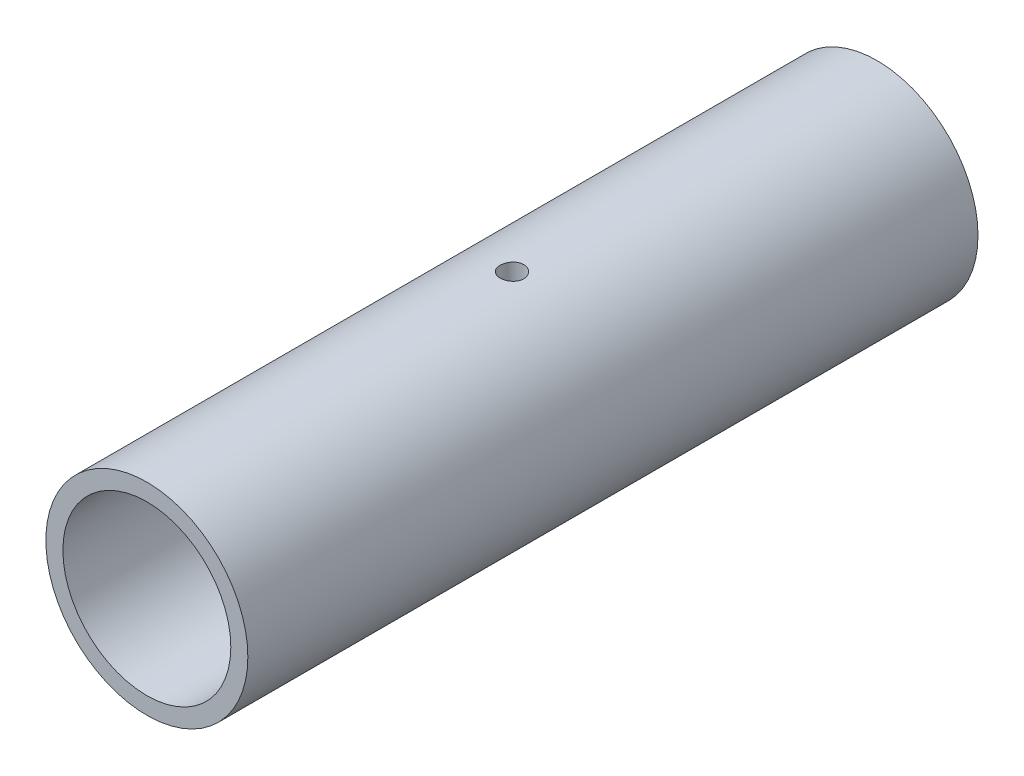
ISO-10303-21;
HEADER;
FILE_DESCRIPTION(('STEP AP214'),'2;1');
FILE_NAME('part.step','',(''),(''),'','','');
FILE_SCHEMA(('AUTOMOTIVE_DESIGN { 1 0 10303 214 1 1 1 1 }'));
ENDSEC;
DATA;
#1=APPLICATION_CONTEXT('core data for automotive mechanical design processes');
#2=APPLICATION_PROTOCOL_DEFINITION('international standard','automotive_design',2000,#1);
#3=PRODUCT_CONTEXT('',#1,'mechanical');
#4=PRODUCT('Part','Part','',(#3));
#5=PRODUCT_RELATED_PRODUCT_CATEGORY('part','',(#4));
#6=PRODUCT_DEFINITION_FORMATION('','',#4);
#7=PRODUCT_DEFINITION_CONTEXT('part definition',#1,'design');
#8=PRODUCT_DEFINITION('design','',#6,#7);
#9=PRODUCT_DEFINITION_SHAPE('','',#8);
#10=(LENGTH_UNIT() NAMED_UNIT(*) SI_UNIT(.MILLI.,.METRE.));
#11=(NAMED_UNIT(*) PLANE_ANGLE_UNIT() SI_UNIT($,.RADIAN.));
#12=(NAMED_UNIT(*) SI_UNIT($,.STERADIAN.) SOLID_ANGLE_UNIT());
#13=UNCERTAINTY_MEASURE_WITH_UNIT(LENGTH_MEASURE(1.E-05),#10,'distance_accuracy_value','');
#14=(GEOMETRIC_REPRESENTATION_CONTEXT(3) GLOBAL_UNCERTAINTY_ASSIGNED_CONTEXT((#13)) GLOBAL_UNIT_ASSIGNED_CONTEXT((#10,
#11,#12)) REPRESENTATION_CONTEXT('',''));
#15=CARTESIAN_POINT('',(0.,0.,0.));
#16=DIRECTION('',(0.,0.,1.));
#17=DIRECTION('',(1.,0.,0.));
#18=AXIS2_PLACEMENT_3D('',#15,#16,#17);
#19=CARTESIAN_POINT('',(-21.0819999999998,21.0819999999998,-152.4));
#20=DIRECTION('',(0.,0.,0.999999999999999));
#21=DIRECTION('',(0.999999999999999,0.,0.));
#22=AXIS2_PLACEMENT_3D('',#19,#20,#21);
#23=CYLINDRICAL_SURFACE('',#22,17.526);
#24=CARTESIAN_POINT('',(-21.0819999999998,21.0819999999998,-152.4));
#25=DIRECTION('',(0.,0.,0.999999999999999));
#26=DIRECTION('',(0.999999999999999,0.,0.));
#27=AXIS2_PLACEMENT_3D('',#24,#25,#26);
#28=CIRCLE('',#27,17.526);
#29=CARTESIAN_POINT('',(-3.55599999999984,21.0819999999998,-152.4));
#30=VERTEX_POINT('',#29);
#31=EDGE_CURVE('E32',#30,#30,#28,.T.);
#32=ORIENTED_EDGE('',*,*,#31,.F.);
#33=EDGE_LOOP('',(#32));
#34=FACE_BOUND('',#33,.T.);
#35=CARTESIAN_POINT('',(-21.082,21.082,0.));
#36=DIRECTION('',(0.,0.,0.999999999999999));
#37=DIRECTION('',(0.999999999999999,0.,0.));
#38=AXIS2_PLACEMENT_3D('',#35,#36,#37);
#39=CIRCLE('',#38,17.526);
#40=CARTESIAN_POINT('',(-3.55600000000007,21.082,0.));
#41=VERTEX_POINT('',#40);
#42=EDGE_CURVE('E45',#41,#41,#39,.T.);
#43=ORIENTED_EDGE('',*,*,#42,.T.);
#44=EDGE_LOOP('',(#43));
#45=FACE_BOUND('',#44,.T.);
#46=CARTESIAN_POINT('',(-21.082,3.55599999999995,-78.65745));
#47=CARTESIAN_POINT('',(-21.219313584699,3.55600209642022,-78.6574442622466));
#48=CARTESIAN_POINT('',(-21.3567093809893,3.55763071351393,-78.6459022714589));
#49=CARTESIAN_POINT('',(-21.627667633178,3.56397088605532,-78.6000469256653));
#50=CARTESIAN_POINT('',(-21.7612261047887,3.56868553297045,-78.5657107358066));
#51=CARTESIAN_POINT('',(-22.0205486108248,3.58066740366486,-78.4753071480244));
#52=CARTESIAN_POINT('',(-22.146318196119,3.58793278441404,-78.4192554376093));
#53=CARTESIAN_POINT('',(-22.3866451043134,3.60421114709342,-78.2870486494609));
#54=CARTESIAN_POINT('',(-22.5012041309102,3.61322386285417,-78.2108966329452));
#55=CARTESIAN_POINT('',(-22.7166653620185,3.63206216037045,-78.0400933465504));
#56=CARTESIAN_POINT('',(-22.8174794946313,3.64189238869374,-77.9453314785533));
#57=CARTESIAN_POINT('',(-23.0018298619565,3.66122096844202,-77.7402362833069));
#58=CARTESIAN_POINT('',(-23.0853651513495,3.67071930168555,-77.6299021046574));
#59=CARTESIAN_POINT('',(-23.2331235961289,3.68835392744121,-77.3962101529735));
#60=CARTESIAN_POINT('',(-23.2972626081304,3.69648421950797,-77.2727986859045));
#61=CARTESIAN_POINT('',(-23.4038702662552,3.71039954073114,-77.0168222523775));
#62=CARTESIAN_POINT('',(-23.4463399438477,3.716184681515,-76.88425772195));
#63=CARTESIAN_POINT('',(-23.5081321629792,3.72470945361032,-76.6146598515697));
#64=CARTESIAN_POINT('',(-23.527604701883,3.72746881184983,-76.4776615261784));
#65=CARTESIAN_POINT('',(-23.5433143500359,3.72968965131678,-76.2023160231005));
#66=CARTESIAN_POINT('',(-23.5395526277443,3.72915129838731,-76.0639689135942));
#67=CARTESIAN_POINT('',(-23.5090233387237,3.72485559083148,-75.7909066955551));
#68=CARTESIAN_POINT('',(-23.4824220706598,3.72112150551341,-75.6561725757621));
#69=CARTESIAN_POINT('',(-23.407228772746,3.7108913913007,-75.3930994293061));
#70=CARTESIAN_POINT('',(-23.3586361930728,3.70439529335092,-75.2647605626253));
#71=CARTESIAN_POINT('',(-23.2406643003693,3.68934710836353,-75.0176106286046));
#72=CARTESIAN_POINT('',(-23.1712137966404,3.68078800009034,-74.8988339876509));
#73=CARTESIAN_POINT('',(-23.0135482916026,3.66258339786613,-74.674557755089));
#74=CARTESIAN_POINT('',(-22.9253322122598,3.65293784151646,-74.5690589268114));
#75=CARTESIAN_POINT('',(-22.7317232165584,3.63354406879054,-74.3733686318438));
#76=CARTESIAN_POINT('',(-22.6261871698088,3.62379569088719,-74.283318728914));
#77=CARTESIAN_POINT('',(-22.4014238936926,3.60537304167416,-74.1221883512029));
#78=CARTESIAN_POINT('',(-22.2821966172447,3.59669877405833,-74.0511079416564));
#79=CARTESIAN_POINT('',(-22.0333181872324,3.58139423424283,-73.9299299563282));
#80=CARTESIAN_POINT('',(-21.9036620654066,3.57476494362076,-73.8798424529004));
#81=CARTESIAN_POINT('',(-21.6376654465838,3.56430574982263,-73.8021907249373));
#82=CARTESIAN_POINT('',(-21.5013253444932,3.56047568147371,-73.7746251714447));
#83=CARTESIAN_POINT('',(-21.2270536681809,3.55606818112011,-73.742986102272));
#84=CARTESIAN_POINT('',(-21.0891449800864,3.555463781399,-73.7387178065238));
#85=CARTESIAN_POINT('',(-20.8145799875361,3.55750255470454,-73.7532786362681));
#86=CARTESIAN_POINT('',(-20.6779236494297,3.56014564021233,-73.772107139308));
#87=CARTESIAN_POINT('',(-20.4103262319333,3.56836569622856,-73.8321651778927));
#88=CARTESIAN_POINT('',(-20.2793636305966,3.57393034406432,-73.8733006500605));
#89=CARTESIAN_POINT('',(-20.026194684721,3.58737120982079,-73.9767063263398));
#90=CARTESIAN_POINT('',(-19.9039887058728,3.59524752421053,-74.0389774124867));
#91=CARTESIAN_POINT('',(-19.6709399354164,3.61250247247454,-74.1833495176409));
#92=CARTESIAN_POINT('',(-19.5601750127325,3.62189041364331,-74.2655751021692));
#93=CARTESIAN_POINT('',(-19.3539476599996,3.64109238959788,-74.447347550135));
#94=CARTESIAN_POINT('',(-19.2584860022372,3.65090644585605,-74.546895287215));
#95=CARTESIAN_POINT('',(-19.084873494318,3.66993912108242,-74.7613496910569));
#96=CARTESIAN_POINT('',(-19.0068526267323,3.67915292852368,-74.8763620766203));
#97=CARTESIAN_POINT('',(-18.8712376307225,3.69585913422194,-75.1179738385939));
#98=CARTESIAN_POINT('',(-18.8136430068646,3.70335157422876,-75.2445729338773));
#99=CARTESIAN_POINT('',(-18.7207205849107,3.7157326732237,-75.505363752403));
#100=CARTESIAN_POINT('',(-18.6853223769144,3.72062955792281,-75.6395299803733));
#101=CARTESIAN_POINT('',(-18.6375723521363,3.72728765905977,-75.9119761976783));
#102=CARTESIAN_POINT('',(-18.625219160628,3.72904906254118,-76.0502559411255));
#103=CARTESIAN_POINT('',(-18.6239394593903,3.72923039684615,-76.3257094488086));
#104=CARTESIAN_POINT('',(-18.6348086578768,3.72767946694316,-76.4628822889183));
#105=CARTESIAN_POINT('',(-18.6792295476167,3.72147393068927,-76.7334295858085));
#106=CARTESIAN_POINT('',(-18.7127812198902,3.71681932693544,-76.8668040457673));
#107=CARTESIAN_POINT('',(-18.8015457855231,3.70494060335147,-77.1259241349824));
#108=CARTESIAN_POINT('',(-18.8567462116219,3.69771796264655,-77.2516741070519));
#109=CARTESIAN_POINT('',(-18.9872212130195,3.68151493200183,-77.4921604771149));
#110=CARTESIAN_POINT('',(-19.0624962934701,3.67253449783099,-77.6068965978607));
#111=CARTESIAN_POINT('',(-19.2317327758756,3.65373341306555,-77.8231390915374));
#112=CARTESIAN_POINT('',(-19.3258459389085,3.64390633406355,-77.9245261453698));
#113=CARTESIAN_POINT('',(-19.5297671042763,3.62457418658418,-78.1101427190558));
#114=CARTESIAN_POINT('',(-19.6395787686698,3.61506919388308,-78.1943682244099));
#115=CARTESIAN_POINT('',(-19.8723927375176,3.5974008099648,-78.3436249326874));
#116=CARTESIAN_POINT('',(-19.9954556347014,3.58924405473427,-78.4085623792496));
#117=CARTESIAN_POINT('',(-20.2507927982238,3.57525690495254,-78.516752085084));
#118=CARTESIAN_POINT('',(-20.3830571605334,3.56942405320852,-78.5600272615678));
#119=CARTESIAN_POINT('',(-20.6102948179795,3.56210435859795,-78.6136216841233));
#120=CARTESIAN_POINT('',(-20.7038521817239,3.5598267289628,-78.6300328107652));
#121=CARTESIAN_POINT('',(-20.8922599526292,3.5567738329563,-78.651948895679));
#122=CARTESIAN_POINT('',(-20.9871103466098,3.55599855128245,-78.6574539650369));
#123=CARTESIAN_POINT('',(-21.082,3.55599999999995,-78.65745));
#124=B_SPLINE_CURVE_WITH_KNOTS('',3,(#46,#47,#48,#49,#50,#51,#52,#53,#54,#55,#56,#57,#58,#59,
#60,#61,#62,#63,#64,#65,#66,#67,#68,#69,#70,#71,#72,#73,#74,#75,#76,#77,#78,#79,#80,#81,#82,#83,
#84,#85,#86,#87,#88,#89,#90,#91,#92,#93,#94,#95,#96,#97,#98,#99,#100,#101,#102,#103,#104,#105,
#106,#107,#108,#109,#110,#111,#112,#113,#114,#115,#116,#117,#118,#119,#120,#121,#122,#123),
.UNSPECIFIED.,.T.,.F.,(4,2,2,2,2,2,2,2,2,2,2,2,2,2,2,2,2,2,2,2,2,2,2,2,2,2,2,2,2,2,2,2,2,2,2,2,
2,2,4),(0.,0.411594074113733,0.823601099863392,1.23531104097033,1.64695831600509,
2.06113037740559,2.47532509201975,2.89129167521455,3.30723845638449,3.72045699906316,
4.13365476100368,4.54386922837036,4.95409395241802,5.36573505181149,5.77739980531222,
6.19265575441998,6.60791313154563,7.02336952086858,7.43880139350359,7.8507546065506,
8.26269671781037,8.67291511996528,9.08315064353467,9.49601608401858,9.90890235340311,
10.3247701537904,10.7406278667108,11.1551596616744,11.569666727386,11.9805423182014,
12.3914175652087,12.8020565406702,13.2127058502912,13.6268071454151,14.0410051978756,
14.4571848396401,14.8729232561056,15.1573555425078,15.4417849317469),.UNSPECIFIED.);
#125=CARTESIAN_POINT('',(-21.082,3.55599999999995,-78.65745));
#126=VERTEX_POINT('',#125);
#127=EDGE_CURVE('E54',#126,#126,#124,.T.);
#128=ORIENTED_EDGE('',*,*,#127,.F.);
#129=EDGE_LOOP('',(#128));
#130=FACE_BOUND('',#129,.T.);
#131=CARTESIAN_POINT('',(-21.082,38.6080000000003,-78.6574499999999));
#132=CARTESIAN_POINT('',(-20.9446864153011,38.6079979035802,-78.6574442622465));
#133=CARTESIAN_POINT('',(-20.8072906190108,38.6063692864857,-78.6459022714589));
#134=CARTESIAN_POINT('',(-20.5363323668221,38.6000291139443,-78.6000469256654));
#135=CARTESIAN_POINT('',(-20.4027738952114,38.5953144670299,-78.5657107358066));
#136=CARTESIAN_POINT('',(-20.1434513891753,38.5833325963355,-78.4753071480244));
#137=CARTESIAN_POINT('',(-20.0176818038811,38.5760672155856,-78.4192554376092));
#138=CARTESIAN_POINT('',(-19.7773548956866,38.5597888529062,-78.2870486494609));
#139=CARTESIAN_POINT('',(-19.6627958690897,38.5507761371462,-78.2108966329452));
#140=CARTESIAN_POINT('',(-19.4473346379814,38.5319378396299,-78.0400933465504));
#141=CARTESIAN_POINT('',(-19.3465205053687,38.5221076113059,-77.9453314785532));
#142=CARTESIAN_POINT('',(-19.1621701380435,38.5027790315576,-77.7402362833068));
#143=CARTESIAN_POINT('',(-19.0786348486503,38.4932806983148,-77.6299021046574));
#144=CARTESIAN_POINT('',(-18.930876403871,38.4756460725591,-77.3962101529735));
#145=CARTESIAN_POINT('',(-18.8667373918697,38.4675157804917,-77.2727986859045));
#146=CARTESIAN_POINT('',(-18.7601297337449,38.4536004592686,-77.0168222523775));
#147=CARTESIAN_POINT('',(-18.7176600561521,38.4478153184854,-76.8842577219501));
#148=CARTESIAN_POINT('',(-18.6558678370207,38.43929054639,-76.6146598515699));
#149=CARTESIAN_POINT('',(-18.6363952981171,38.4365311881499,-76.4776615261785));
#150=CARTESIAN_POINT('',(-18.6206856499643,38.4343103486829,-76.2023160231006));
#151=CARTESIAN_POINT('',(-18.6244473722558,38.434848701613,-76.0639689135943));
#152=CARTESIAN_POINT('',(-18.6549766612764,38.4391444091689,-75.7909066955552));
#153=CARTESIAN_POINT('',(-18.6815779293403,38.4428784944864,-75.6561725757622));
#154=CARTESIAN_POINT('',(-18.7567712272541,38.4531086086989,-75.3930994293062));
#155=CARTESIAN_POINT('',(-18.8053638069271,38.4596047066491,-75.2647605626253));
#156=CARTESIAN_POINT('',(-18.9233356996306,38.4746528916365,-75.0176106286046));
#157=CARTESIAN_POINT('',(-18.9927862033597,38.4832119999093,-74.898833987651));
#158=CARTESIAN_POINT('',(-19.1504517083975,38.5014166021335,-74.6745577550891));
#159=CARTESIAN_POINT('',(-19.2386677877401,38.5110621584836,-74.5690589268114));
#160=CARTESIAN_POINT('',(-19.4322767834415,38.5304559312095,-74.3733686318438));
#161=CARTESIAN_POINT('',(-19.5378128301912,38.5402043091125,-74.2833187289141));
#162=CARTESIAN_POINT('',(-19.7625761063074,38.5586269583255,-74.122188351203));
#163=CARTESIAN_POINT('',(-19.8818033827552,38.5673012259417,-74.0511079416564));
#164=CARTESIAN_POINT('',(-20.1306818127674,38.5826057657572,-73.9299299563282));
#165=CARTESIAN_POINT('',(-20.2603379345933,38.5892350563789,-73.8798424529005));
#166=CARTESIAN_POINT('',(-20.5263345534161,38.599694250177,-73.8021907249373));
#167=CARTESIAN_POINT('',(-20.6626746555067,38.6035243185263,-73.7746251714447));
#168=CARTESIAN_POINT('',(-20.936946331819,38.6079318188799,-73.7429861022719));
#169=CARTESIAN_POINT('',(-21.0748550199134,38.6085362186006,-73.7387178065237));
#170=CARTESIAN_POINT('',(-21.3494200124638,38.6064974452951,-73.7532786362682));
#171=CARTESIAN_POINT('',(-21.4860763505702,38.6038543597877,-73.7721071393081));
#172=CARTESIAN_POINT('',(-21.7536737680666,38.5956343037714,-73.8321651778927));
#173=CARTESIAN_POINT('',(-21.8846363694033,38.5900696559353,-73.8733006500604));
#174=CARTESIAN_POINT('',(-22.137805315279,38.5766287901788,-73.9767063263398));
#175=CARTESIAN_POINT('',(-22.2600112941272,38.5687524757895,-74.0389774124866));
#176=CARTESIAN_POINT('',(-22.4930600645837,38.5514975275255,-74.1833495176409));
#177=CARTESIAN_POINT('',(-22.6038249872676,38.5421095863563,-74.2655751021692));
#178=CARTESIAN_POINT('',(-22.8100523400005,38.5229076104017,-74.447347550135));
#179=CARTESIAN_POINT('',(-22.9055139977628,38.513093554144,-74.546895287215));
#180=CARTESIAN_POINT('',(-23.0791265056821,38.4940608789176,-74.7613496910569));
#181=CARTESIAN_POINT('',(-23.1571473732678,38.4848470714758,-74.8763620766203));
#182=CARTESIAN_POINT('',(-23.2927623692775,38.4681408657777,-75.1179738385938));
#183=CARTESIAN_POINT('',(-23.3503569931353,38.4606484257714,-75.2445729338773));
#184=CARTESIAN_POINT('',(-23.4432794150892,38.4482673267764,-75.505363752403));
#185=CARTESIAN_POINT('',(-23.4786776230857,38.4433704420767,-75.6395299803733));
#186=CARTESIAN_POINT('',(-23.5264276478638,38.4367123409398,-75.9119761976782));
#187=CARTESIAN_POINT('',(-23.5387808393719,38.4349509374591,-76.0502559411254));
#188=CARTESIAN_POINT('',(-23.5400605406096,38.4347696031541,-76.3257094488086));
#189=CARTESIAN_POINT('',(-23.5291913421233,38.4363205330564,-76.4628822889183));
#190=CARTESIAN_POINT('',(-23.4847704523834,38.4425260693103,-76.7334295858086));
#191=CARTESIAN_POINT('',(-23.4512187801097,38.4471806730649,-76.8668040457673));
#192=CARTESIAN_POINT('',(-23.3624542144768,38.4590593966489,-77.1259241349824));
#193=CARTESIAN_POINT('',(-23.307253788378,38.466282037353,-77.251674107052));
#194=CARTESIAN_POINT('',(-23.1767787869806,38.4824850679978,-77.492160477115));
#195=CARTESIAN_POINT('',(-23.10150370653,38.4914655021694,-77.6068965978607));
#196=CARTESIAN_POINT('',(-22.9322672241245,38.5102665869348,-77.8231390915374));
#197=CARTESIAN_POINT('',(-22.8381540610916,38.520093665936,-77.9245261453699));
#198=CARTESIAN_POINT('',(-22.6342328957236,38.5394258134154,-78.1101427190559));
#199=CARTESIAN_POINT('',(-22.5244212313301,38.5489308061172,-78.1943682244098));
#200=CARTESIAN_POINT('',(-22.2916072624822,38.5665991900355,-78.3436249326874));
#201=CARTESIAN_POINT('',(-22.1685443652984,38.5747559452653,-78.4085623792497));
#202=CARTESIAN_POINT('',(-21.913207201776,38.5887430950471,-78.5167520850841));
#203=CARTESIAN_POINT('',(-21.7809428394664,38.594575946792,-78.5600272615678));
#204=CARTESIAN_POINT('',(-21.5537051820204,38.6018956414023,-78.6136216841233));
#205=CARTESIAN_POINT('',(-21.460147818276,38.6041732710368,-78.6300328107653));
#206=CARTESIAN_POINT('',(-21.2717400473708,38.6072261670433,-78.651948895679));
#207=CARTESIAN_POINT('',(-21.1768896533903,38.6080014487177,-78.6574539650368));
#208=CARTESIAN_POINT('',(-21.082,38.6080000000003,-78.6574499999999));
#209=B_SPLINE_CURVE_WITH_KNOTS('',3,(#131,#132,#133,#134,#135,#136,#137,#138,#139,#140,#141,
#142,#143,#144,#145,#146,#147,#148,#149,#150,#151,#152,#153,#154,#155,#156,#157,#158,#159,#160,
#161,#162,#163,#164,#165,#166,#167,#168,#169,#170,#171,#172,#173,#174,#175,#176,#177,#178,#179,
#180,#181,#182,#183,#184,#185,#186,#187,#188,#189,#190,#191,#192,#193,#194,#195,#196,#197,#198,
#199,#200,#201,#202,#203,#204,#205,#206,#207,#208),.UNSPECIFIED.,.T.,.F.,(4,2,2,2,2,2,2,2,2,2,2,
2,2,2,2,2,2,2,2,2,2,2,2,2,2,2,2,2,2,2,2,2,2,2,2,2,2,2,4),(0.,0.411594074113725,
0.823601099863367,1.23531104097039,1.64695831600524,2.06113037740572,2.47532509201988,
2.89129167521462,3.30723845638447,3.72045699906311,4.13365476100364,4.54386922837037,
4.95409395241802,5.36573505181149,5.7773998053122,6.19265575441994,6.60791313154559,
7.02336952086855,7.43880139350355,7.85075460655054,8.26269671781033,8.67291511996534,
9.08315064353482,9.49601608401872,9.90890235340325,10.3247701537905,10.7406278667108,
11.1551596616745,11.5696667273861,11.9805423182015,12.3914175652088,12.8020565406704,
13.2127058502913,13.6268071454152,14.0410051978758,14.4571848396403,14.8729232561058,
15.1573555425079,15.4417849317469),.UNSPECIFIED.);
#210=CARTESIAN_POINT('',(-21.082,38.6080000000003,-78.6574499999999));
#211=VERTEX_POINT('',#210);
#212=EDGE_CURVE('E48',#211,#211,#209,.T.);
#213=ORIENTED_EDGE('',*,*,#212,.F.);
#214=EDGE_LOOP('',(#213));
#215=FACE_BOUND('',#214,.T.);
#216=ADVANCED_FACE('F12',(#34,#45,#130,#215),#23,.F.);
#217=CARTESIAN_POINT('',(-21.0819999999998,21.0819999999998,-152.4));
#218=DIRECTION('',(0.,0.,0.999999999999999));
#219=DIRECTION('',(0.999999999999999,0.,0.));
#220=AXIS2_PLACEMENT_3D('',#217,#218,#219);
#221=CYLINDRICAL_SURFACE('',#220,21.082);
#222=CARTESIAN_POINT('',(-21.082,21.082,0.));
#223=DIRECTION('',(0.,0.,0.999999999999999));
#224=DIRECTION('',(0.999999999999999,0.,0.));
#225=AXIS2_PLACEMENT_3D('',#222,#223,#224);
#226=CIRCLE('',#225,21.082);
#227=CARTESIAN_POINT('',(0.,21.082,0.));
#228=VERTEX_POINT('',#227);
#229=EDGE_CURVE('E41',#228,#228,#226,.T.);
#230=ORIENTED_EDGE('',*,*,#229,.F.);
#231=EDGE_LOOP('',(#230));
#232=FACE_BOUND('',#231,.T.);
#233=CARTESIAN_POINT('',(-21.0819999999998,21.0819999999998,-152.4));
#234=DIRECTION('',(0.,0.,0.999999999999999));
#235=DIRECTION('',(0.999999999999999,0.,0.));
#236=AXIS2_PLACEMENT_3D('',#233,#234,#235);
#237=CIRCLE('',#236,21.082);
#238=CARTESIAN_POINT('',(1.52655665885959E-13,21.0819999999998,-152.4));
#239=VERTEX_POINT('',#238);
#240=EDGE_CURVE('E23',#239,#239,#237,.T.);
#241=ORIENTED_EDGE('',*,*,#240,.T.);
#242=EDGE_LOOP('',(#241));
#243=FACE_BOUND('',#242,.T.);
#244=CARTESIAN_POINT('',(-21.082,42.1640000000003,-78.6574499999999));
#245=CARTESIAN_POINT('',(-20.9444644128489,42.1639981896703,-78.6574441133679));
#246=CARTESIAN_POINT('',(-20.8068410729085,42.1626398639896,-78.6458649518291));
#247=CARTESIAN_POINT('',(-20.5354188670991,42.1573518736463,-78.5998532969384));
#248=CARTESIAN_POINT('',(-20.4016242328091,42.1534194705401,-78.5653964645158));
#249=CARTESIAN_POINT('',(-20.1418285200257,42.1434266548059,-78.4746540359121));
#250=CARTESIAN_POINT('',(-20.0158224509763,42.1373676218032,-78.4183825892291));
#251=CARTESIAN_POINT('',(-19.7750680496314,42.1237967399054,-78.2856380093583));
#252=CARTESIAN_POINT('',(-19.6603176806375,42.1162851545807,-78.209168540248));
#253=CARTESIAN_POINT('',(-19.4447540663791,42.1006083763951,-78.0378043334997));
#254=CARTESIAN_POINT('',(-19.3440028000324,42.0924405147707,-77.9428318673855));
#255=CARTESIAN_POINT('',(-19.1598307768086,42.076393466281,-77.7373241906216));
#256=CARTESIAN_POINT('',(-19.0764108725656,42.0685142936337,-77.6267882147575));
#257=CARTESIAN_POINT('',(-18.9290423957565,42.0539101911831,-77.3928933010846));
#258=CARTESIAN_POINT('',(-18.8651512364394,42.0471886896702,-77.2694979568614));
#259=CARTESIAN_POINT('',(-18.7590205029762,42.0356955439044,-77.0136380909333));
#260=CARTESIAN_POINT('',(-18.7167802121994,42.0309238351158,-76.8811738695672));
#261=CARTESIAN_POINT('',(-18.6553371095601,42.0238956403553,-76.6115762423735));
#262=CARTESIAN_POINT('',(-18.6360302213175,42.0216277946848,-76.4744668574789));
#263=CARTESIAN_POINT('',(-18.6206800442439,42.0198291899757,-76.1989366398657));
#264=CARTESIAN_POINT('',(-18.6246359375943,42.0202983347163,-76.0605158534211));
#265=CARTESIAN_POINT('',(-18.655613474821,42.0239103117648,-75.7870145438806));
#266=CARTESIAN_POINT('',(-18.6825208418816,42.0270398973114,-75.6519208777595));
#267=CARTESIAN_POINT('',(-18.7584594014298,42.0355994649233,-75.3881797186206));
#268=CARTESIAN_POINT('',(-18.8074909885016,42.0410294880166,-75.2595323406174));
#269=CARTESIAN_POINT('',(-18.9264101851965,42.0535932157184,-75.011978403679));
#270=CARTESIAN_POINT('',(-18.9963478303252,42.0607309993205,-74.8930960960935));
#271=CARTESIAN_POINT('',(-19.1550580213817,42.0759027542919,-74.6687125412231));
#272=CARTESIAN_POINT('',(-19.2438313168173,42.0839367613176,-74.5632118266853));
#273=CARTESIAN_POINT('',(-19.4383279744758,42.1000546873897,-74.3679226587122));
#274=CARTESIAN_POINT('',(-19.544149907484,42.10813861649,-74.2782323476546));
#275=CARTESIAN_POINT('',(-19.7693995142763,42.123400264565,-74.1178728596449));
#276=CARTESIAN_POINT('',(-19.8888272128769,42.1305779818868,-74.0472037173877));
#277=CARTESIAN_POINT('',(-20.1379711415483,42.1432221258942,-73.9268939862445));
#278=CARTESIAN_POINT('',(-20.2676901603032,42.1486880867389,-73.8772591203739));
#279=CARTESIAN_POINT('',(-20.5336991303931,42.1572884694048,-73.8005026322442));
#280=CARTESIAN_POINT('',(-20.6699888141772,42.1604229860746,-73.7733800941238));
#281=CARTESIAN_POINT('',(-20.9444212882666,42.1639950339558,-73.7425443948493));
#282=CARTESIAN_POINT('',(-21.0825486836278,42.1644481503476,-73.7386959541073));
#283=CARTESIAN_POINT('',(-21.3574804787674,42.1626483192137,-73.7541613017361));
#284=CARTESIAN_POINT('',(-21.4942849029258,42.1603954216509,-73.7734746624555));
#285=CARTESIAN_POINT('',(-21.7622913654381,42.1534464899951,-73.8346030454453));
#286=CARTESIAN_POINT('',(-21.8935082160526,42.148757415072,-73.8763539842865));
#287=CARTESIAN_POINT('',(-22.1470770901542,42.1374614675239,-73.9811060215454));
#288=CARTESIAN_POINT('',(-22.2694288487069,42.1308545376131,-74.0441077547283));
#289=CARTESIAN_POINT('',(-22.502401305639,42.116421455777,-74.1899032535193));
#290=CARTESIAN_POINT('',(-22.6129665917272,42.1085899380498,-74.2727850245395));
#291=CARTESIAN_POINT('',(-22.8186648265723,42.0926017013239,-74.4558627825721));
#292=CARTESIAN_POINT('',(-22.9137972449386,42.0844449711605,-74.5560593644088));
#293=CARTESIAN_POINT('',(-23.0864055591656,42.0686779589736,-74.7715164290804));
#294=CARTESIAN_POINT('',(-23.1637920977477,42.0610705691354,-74.8868487404975));
#295=CARTESIAN_POINT('',(-23.2980957214879,42.0473099402236,-75.1289527981102));
#296=CARTESIAN_POINT('',(-23.355013171095,42.0411566752603,-75.2557243405818));
#297=CARTESIAN_POINT('',(-23.4466164798638,42.0310201779777,-75.5168134210649));
#298=CARTESIAN_POINT('',(-23.4813537244218,42.0270319331441,-75.6511127276454));
#299=CARTESIAN_POINT('',(-23.5277765159362,42.0216622759768,-75.9236873183407));
#300=CARTESIAN_POINT('',(-23.5394629849245,42.020280759374,-76.0619624431983));
#301=CARTESIAN_POINT('',(-23.5394370708632,42.0202837303198,-76.3376749161658));
#302=CARTESIAN_POINT('',(-23.5278650584213,42.0216516245053,-76.4751122989259));
#303=CARTESIAN_POINT('',(-23.4819468591478,42.0269637239781,-76.7460751763494));
#304=CARTESIAN_POINT('',(-23.4476006605476,42.0309079305967,-76.8796006689915));
#305=CARTESIAN_POINT('',(-23.3571511294317,42.0409233045324,-77.1389372003668));
#306=CARTESIAN_POINT('',(-23.3010536229897,42.0469939022551,-77.2647502944196));
#307=CARTESIAN_POINT('',(-23.1687078146467,42.0605790794332,-77.5051991675268));
#308=CARTESIAN_POINT('',(-23.0924593911784,42.0680936675999,-77.6198348791443));
#309=CARTESIAN_POINT('',(-22.921452677608,42.0837744977372,-77.835393379043));
#310=CARTESIAN_POINT('',(-22.8265896915736,42.0919442634249,-77.9362328582048));
#311=CARTESIAN_POINT('',(-22.6212624117664,42.1079833622732,-78.1206178870807));
#312=CARTESIAN_POINT('',(-22.5107944252909,42.1158526237623,-78.2041593318885));
#313=CARTESIAN_POINT('',(-22.2769769513209,42.1304324834559,-78.3518081882211));
#314=CARTESIAN_POINT('',(-22.153585838109,42.1371391405083,-78.4158500316198));
#315=CARTESIAN_POINT('',(-21.8977950896914,42.1485974023543,-78.5222151190348));
#316=CARTESIAN_POINT('',(-21.7654055601761,42.1533511594191,-78.5645622853249));
#317=CARTESIAN_POINT('',(-21.5405890879154,42.1592043875156,-78.6160454079474));
#318=CARTESIAN_POINT('',(-21.4495873323943,42.1609941178969,-78.6315502180808));
#319=CARTESIAN_POINT('',(-21.2664035312263,42.1633925274692,-78.6522544561953));
#320=CARTESIAN_POINT('',(-21.1742214927955,42.1640012138777,-78.6574539471528));
#321=CARTESIAN_POINT('',(-21.082,42.1640000000003,-78.6574499999999));
#322=B_SPLINE_CURVE_WITH_KNOTS('',3,(#244,#245,#246,#247,#248,#249,#250,#251,#252,#253,#254,
#255,#256,#257,#258,#259,#260,#261,#262,#263,#264,#265,#266,#267,#268,#269,#270,#271,#272,#273,
#274,#275,#276,#277,#278,#279,#280,#281,#282,#283,#284,#285,#286,#287,#288,#289,#290,#291,#292,
#293,#294,#295,#296,#297,#298,#299,#300,#301,#302,#303,#304,#305,#306,#307,#308,#309,#310,#311,
#312,#313,#314,#315,#316,#317,#318,#319,#320,#321),.UNSPECIFIED.,.T.,.F.,(4,2,2,2,2,2,2,2,2,2,2,
2,2,2,2,2,2,2,2,2,2,2,2,2,2,2,2,2,2,2,2,2,2,2,2,2,2,2,4),(0.,0.412269941606798,
0.824979192800648,1.23742119725815,1.64978843287182,2.06392684568482,2.47808562764066,
2.89345055103039,3.30880172520558,3.72226066186233,4.1357050631837,4.54710283560507,
4.95850794557343,5.37090568455279,5.78331983673378,6.19821019320771,6.61310130643732,
7.02810523106399,7.44309227140166,7.85566488287464,8.26822987686847,8.6796227677794,
9.09102794815913,9.50428909680521,9.91756444523802,10.3328772064413,10.7481825727001,
11.162522266582,11.5768453865226,11.9886754741002,12.4005057744904,12.8122258425142,
13.2239483944366,13.6380566877445,14.0522631385877,14.4678473721359,14.8829723577925,
15.1594126783116,15.4358513094848),.UNSPECIFIED.);
#323=CARTESIAN_POINT('',(-21.082,42.1640000000003,-78.6574499999999));
#324=VERTEX_POINT('',#323);
#325=EDGE_CURVE('E50',#324,#324,#322,.T.);
#326=ORIENTED_EDGE('',*,*,#325,.T.);
#327=EDGE_LOOP('',(#326));
#328=FACE_BOUND('',#327,.T.);
#329=CARTESIAN_POINT('',(-21.082,0.,-78.6574499999999));
#330=CARTESIAN_POINT('',(-21.2195355871512,1.810330175566E-06,-78.6574441133679));
#331=CARTESIAN_POINT('',(-21.3571589270916,0.00136013601006596,-78.6458649518292));
#332=CARTESIAN_POINT('',(-21.6285811329008,0.00664812635326151,-78.5998532969384));
#333=CARTESIAN_POINT('',(-21.7623757671908,0.0105805294602173,-78.5653964645157));
#334=CARTESIAN_POINT('',(-22.0221714799742,0.0205733451944307,-78.474654035912));
#335=CARTESIAN_POINT('',(-22.1481775490237,0.02663237819641,-78.4183825892292));
#336=CARTESIAN_POINT('',(-22.3889319503686,0.0402032600942374,-78.2856380093584));
#337=CARTESIAN_POINT('',(-22.5036823193624,0.0477148454197174,-78.2091685402479));
#338=CARTESIAN_POINT('',(-22.7192459336208,0.0633916236053231,-78.0378043334995));
#339=CARTESIAN_POINT('',(-22.8199971999677,0.0715594852290092,-77.9428318673855));
#340=CARTESIAN_POINT('',(-23.0041692231914,0.0876065337186863,-77.7373241906216));
#341=CARTESIAN_POINT('',(-23.0875891274342,0.0954857063666281,-77.6267882147574));
#342=CARTESIAN_POINT('',(-23.2349576042434,0.110089808817224,-77.3928933010845));
#343=CARTESIAN_POINT('',(-23.2988487635607,0.116811310329518,-77.2694979568614));
#344=CARTESIAN_POINT('',(-23.4049794970239,0.12830445609527,-77.0136380909333));
#345=CARTESIAN_POINT('',(-23.4472197878004,0.133076164884623,-76.8811738695671));
#346=CARTESIAN_POINT('',(-23.5086628904397,0.14010435964512,-76.6115762423733));
#347=CARTESIAN_POINT('',(-23.5279697786826,0.14237220531485,-76.4744668574788));
#348=CARTESIAN_POINT('',(-23.5433199557562,0.144170810023909,-76.1989366398656));
#349=CARTESIAN_POINT('',(-23.5393640624056,0.143701665283949,-76.060515853421));
#350=CARTESIAN_POINT('',(-23.5083865251789,0.140089688235575,-75.7870145438805));
#351=CARTESIAN_POINT('',(-23.4814791581184,0.136960102688349,-75.6519208777594));
#352=CARTESIAN_POINT('',(-23.4055405985702,0.128400535076317,-75.3881797186204));
#353=CARTESIAN_POINT('',(-23.3565090114983,0.122970511983439,-75.2595323406173));
#354=CARTESIAN_POINT('',(-23.2375898148034,0.110406784281655,-75.0119784036789));
#355=CARTESIAN_POINT('',(-23.1676521696747,0.1032690006791,-74.8930960960933));
#356=CARTESIAN_POINT('',(-23.0089419786182,0.0880972457077293,-74.6687125412229));
#357=CARTESIAN_POINT('',(-22.9201686831826,0.0800632386824426,-74.5632118266852));
#358=CARTESIAN_POINT('',(-22.725672025524,0.0639453126103484,-74.3679226587121));
#359=CARTESIAN_POINT('',(-22.619850092516,0.0558613835096492,-74.2782323476545));
#360=CARTESIAN_POINT('',(-22.3946004857237,0.0405997354346204,-74.1178728596449));
#361=CARTESIAN_POINT('',(-22.2751727871232,0.0334220181132356,-74.0472037173875));
#362=CARTESIAN_POINT('',(-22.0260288584518,0.0207778741058077,-73.9268939862443));
#363=CARTESIAN_POINT('',(-21.8963098396968,0.0153119132606842,-73.8772591203738));
#364=CARTESIAN_POINT('',(-21.6303008696068,0.00671153059486654,-73.8005026322441));
#365=CARTESIAN_POINT('',(-21.4940111858227,0.00357701392537317,-73.7733800941237));
#366=CARTESIAN_POINT('',(-21.2195787117333,4.96604417280258E-06,-73.7425443948492));
#367=CARTESIAN_POINT('',(-21.0814513163722,-0.000448150347954495,-73.7386959541073));
#368=CARTESIAN_POINT('',(-20.8065195212326,0.00135168078596099,-73.7541613017361));
#369=CARTESIAN_POINT('',(-20.6697150970743,0.00360457834910945,-73.7734746624555));
#370=CARTESIAN_POINT('',(-20.401708634562,0.0105535100049108,-73.8346030454453));
#371=CARTESIAN_POINT('',(-20.2704917839475,0.0152425849275855,-73.8763539842865));
#372=CARTESIAN_POINT('',(-20.0169229098457,0.0265385324756857,-73.9811060215455));
#373=CARTESIAN_POINT('',(-19.894571151293,0.0331454623869666,-74.0441077547284));
#374=CARTESIAN_POINT('',(-19.6615986943609,0.0475785442229833,-74.1899032535194));
#375=CARTESIAN_POINT('',(-19.5510334082727,0.0554100619498288,-74.2727850245397));
#376=CARTESIAN_POINT('',(-19.3453351734276,0.0713982986757219,-74.4558627825722));
#377=CARTESIAN_POINT('',(-19.2502027550612,0.0795550288395444,-74.5560593644088));
#378=CARTESIAN_POINT('',(-19.0775944408343,0.0953220410263554,-74.7715164290804));
#379=CARTESIAN_POINT('',(-19.0002079022524,0.102929430864129,-74.8868487404976));
#380=CARTESIAN_POINT('',(-18.8659042785121,0.116690059775987,-75.1289527981103));
#381=CARTESIAN_POINT('',(-18.8089868289049,0.122843324739868,-75.2557243405818));
#382=CARTESIAN_POINT('',(-18.7173835201361,0.132979822022447,-75.5168134210649));
#383=CARTESIAN_POINT('',(-18.6826462755783,0.136968066855462,-75.6511127276454));
#384=CARTESIAN_POINT('',(-18.6362234840639,0.142337724022816,-75.9236873183408));
#385=CARTESIAN_POINT('',(-18.6245370150754,0.143719240626298,-76.0619624431984));
#386=CARTESIAN_POINT('',(-18.6245629291366,0.143716269680527,-76.3376749161658));
#387=CARTESIAN_POINT('',(-18.6361349415788,0.142348375494224,-76.4751122989258));
#388=CARTESIAN_POINT('',(-18.6820531408523,0.137036276021431,-76.7460751763494));
#389=CARTESIAN_POINT('',(-18.7163993394523,0.133092069403636,-76.8796006689915));
#390=CARTESIAN_POINT('',(-18.8068488705682,0.123076695467876,-77.1389372003668));
#391=CARTESIAN_POINT('',(-18.8629463770103,0.11700609774444,-77.2647502944194));
#392=CARTESIAN_POINT('',(-18.9952921853533,0.103420920566358,-77.5051991675267));
#393=CARTESIAN_POINT('',(-19.0715406088215,0.095906332400421,-77.6198348791443));
#394=CARTESIAN_POINT('',(-19.2425473223919,0.0802255022631431,-77.835393379043));
#395=CARTESIAN_POINT('',(-19.3374103084263,0.0720557365747201,-77.9362328582046));
#396=CARTESIAN_POINT('',(-19.5427375882336,0.0560166377264021,-78.1206178870806));
#397=CARTESIAN_POINT('',(-19.653205574709,0.0481473762380959,-78.2041593318886));
#398=CARTESIAN_POINT('',(-19.8870230486789,0.0335675165444599,-78.3518081882212));
#399=CARTESIAN_POINT('',(-20.0104141618909,0.0268608594912241,-78.4158500316197));
#400=CARTESIAN_POINT('',(-20.2662049103087,0.0154025976453418,-78.5222151190347));
#401=CARTESIAN_POINT('',(-20.398594439824,0.010648840581425,-78.5645622853248));
#402=CARTESIAN_POINT('',(-20.6234109120847,0.00479561248461294,-78.6160454079474));
#403=CARTESIAN_POINT('',(-20.7144126676057,0.00300588210271605,-78.6315502180808));
#404=CARTESIAN_POINT('',(-20.8975964687738,0.00060747253038143,-78.6522544561953));
#405=CARTESIAN_POINT('',(-20.9897785072046,-1.21387747492502E-06,-78.6574539471527));
#406=CARTESIAN_POINT('',(-21.082,0.,-78.6574499999999));
#407=B_SPLINE_CURVE_WITH_KNOTS('',3,(#329,#330,#331,#332,#333,#334,#335,#336,#337,#338,#339,
#340,#341,#342,#343,#344,#345,#346,#347,#348,#349,#350,#351,#352,#353,#354,#355,#356,#357,#358,
#359,#360,#361,#362,#363,#364,#365,#366,#367,#368,#369,#370,#371,#372,#373,#374,#375,#376,#377,
#378,#379,#380,#381,#382,#383,#384,#385,#386,#387,#388,#389,#390,#391,#392,#393,#394,#395,#396,
#397,#398,#399,#400,#401,#402,#403,#404,#405,#406),.UNSPECIFIED.,.T.,.F.,(4,2,2,2,2,2,2,2,2,2,2,
2,2,2,2,2,2,2,2,2,2,2,2,2,2,2,2,2,2,2,2,2,2,2,2,2,2,2,4),(0.,0.412269941606704,
0.824979192800478,1.237421197258,1.64978843287169,2.06392684568473,2.47808562764058,
2.89345055103032,3.30880172520553,3.72226066186231,4.13570506318368,4.54710283560505,
4.95850794557344,5.3709056845528,5.7833198367338,6.19821019320763,6.61310130643716,
7.02810523106393,7.4430922714017,7.85566488287458,8.26822987686829,8.67962276777934,
9.09102794815921,9.50428909680525,9.91756444523801,10.3328772064413,10.7481825727001,
11.1625222665819,11.5768453865225,11.9886754741001,12.4005057744903,12.8122258425141,
13.2239483944364,13.6380566877443,14.0522631385875,14.4678473721359,14.8829723577925,
15.1594126783116,15.4358513094849),.UNSPECIFIED.);
#408=CARTESIAN_POINT('',(-21.082,0.,-78.6574499999999));
#409=VERTEX_POINT('',#408);
#410=EDGE_CURVE('E8',#409,#409,#407,.T.);
#411=ORIENTED_EDGE('',*,*,#410,.T.);
#412=EDGE_LOOP('',(#411));
#413=FACE_BOUND('',#412,.T.);
#414=ADVANCED_FACE('F55',(#232,#243,#328,#413),#221,.T.);
#415=CARTESIAN_POINT('',(-21.0819999999998,21.0819999999998,-152.4));
#416=DIRECTION('',(0.,0.,0.999999999999999));
#417=DIRECTION('',(0.999999999999999,0.,0.));
#418=AXIS2_PLACEMENT_3D('',#415,#416,#417);
#419=PLANE('',#418);
#420=ORIENTED_EDGE('',*,*,#31,.T.);
#421=EDGE_LOOP('',(#420));
#422=FACE_BOUND('',#421,.T.);
#423=ORIENTED_EDGE('',*,*,#240,.F.);
#424=EDGE_LOOP('',(#423));
#425=FACE_BOUND('',#424,.T.);
#426=ADVANCED_FACE('F65',(#422,#425),#419,.F.);
#427=CARTESIAN_POINT('',(-21.082,21.082,0.));
#428=DIRECTION('',(0.,0.,0.999999999999999));
#429=DIRECTION('',(0.999999999999999,0.,0.));
#430=AXIS2_PLACEMENT_3D('',#427,#428,#429);
#431=PLANE('',#430);
#432=ORIENTED_EDGE('',*,*,#42,.F.);
#433=EDGE_LOOP('',(#432));
#434=FACE_BOUND('',#433,.T.);
#435=ORIENTED_EDGE('',*,*,#229,.T.);
#436=EDGE_LOOP('',(#435));
#437=FACE_BOUND('',#436,.T.);
#438=ADVANCED_FACE('F63',(#434,#437),#431,.T.);
#439=CARTESIAN_POINT('',(-21.082,311.31621471874,-76.2));
#440=DIRECTION('',(0.,-1.,0.));
#441=DIRECTION('',(0.,0.,-0.999999999999999));
#442=AXIS2_PLACEMENT_3D('',#439,#440,#441);
#443=CYLINDRICAL_SURFACE('',#442,2.45745);
#444=ORIENTED_EDGE('',*,*,#325,.F.);
#445=EDGE_LOOP('',(#444));
#446=FACE_BOUND('',#445,.T.);
#447=ORIENTED_EDGE('',*,*,#212,.T.);
#448=EDGE_LOOP('',(#447));
#449=FACE_BOUND('',#448,.T.);
#450=ADVANCED_FACE('F58',(#446,#449),#443,.F.);
#451=ORIENTED_EDGE('',*,*,#410,.F.);
#452=EDGE_LOOP('',(#451));
#453=FACE_BOUND('',#452,.T.);
#454=ORIENTED_EDGE('',*,*,#127,.T.);
#455=EDGE_LOOP('',(#454));
#456=FACE_BOUND('',#455,.T.);
#457=ADVANCED_FACE('F62',(#453,#456),#443,.F.);
#458=CLOSED_SHELL('',(#216,#414,#426,#438,#450,#457));
#459=MANIFOLD_SOLID_BREP('B1',#458);
#460=ADVANCED_BREP_SHAPE_REPRESENTATION('',(#18,#459),#14);
#461=SHAPE_DEFINITION_REPRESENTATION(#9,#460);
ENDSEC;
END-ISO-10303-21;
